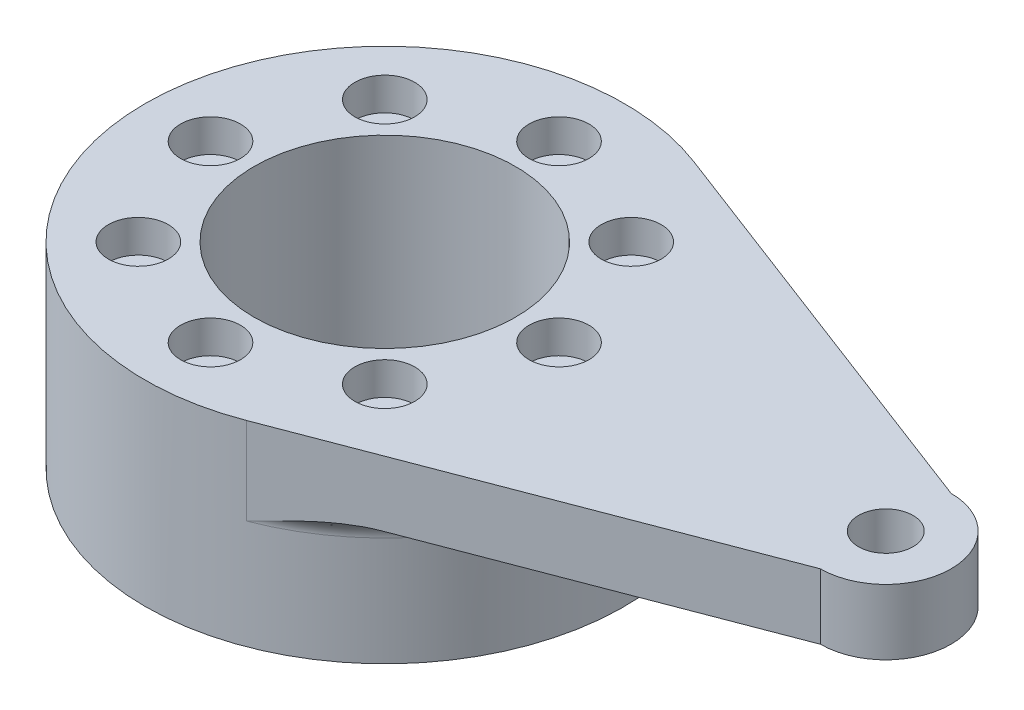
ISO-10303-21;
HEADER;
FILE_DESCRIPTION(('STEP AP214'),'2;1');
FILE_NAME('part.step','',(''),(''),'','','');
FILE_SCHEMA(('AUTOMOTIVE_DESIGN { 1 0 10303 214 1 1 1 1 }'));
ENDSEC;
DATA;
#1=APPLICATION_CONTEXT('core data for automotive mechanical design processes');
#2=APPLICATION_PROTOCOL_DEFINITION('international standard','automotive_design',2000,#1);
#3=PRODUCT_CONTEXT('',#1,'mechanical');
#4=PRODUCT('Part','Part','',(#3));
#5=PRODUCT_RELATED_PRODUCT_CATEGORY('part','',(#4));
#6=PRODUCT_DEFINITION_FORMATION('','',#4);
#7=PRODUCT_DEFINITION_CONTEXT('part definition',#1,'design');
#8=PRODUCT_DEFINITION('design','',#6,#7);
#9=PRODUCT_DEFINITION_SHAPE('','',#8);
#10=(LENGTH_UNIT() NAMED_UNIT(*) SI_UNIT(.MILLI.,.METRE.));
#11=(NAMED_UNIT(*) PLANE_ANGLE_UNIT() SI_UNIT($,.RADIAN.));
#12=(NAMED_UNIT(*) SI_UNIT($,.STERADIAN.) SOLID_ANGLE_UNIT());
#13=UNCERTAINTY_MEASURE_WITH_UNIT(LENGTH_MEASURE(1.E-05),#10,'distance_accuracy_value','');
#14=(GEOMETRIC_REPRESENTATION_CONTEXT(3) GLOBAL_UNCERTAINTY_ASSIGNED_CONTEXT((#13)) GLOBAL_UNIT_ASSIGNED_CONTEXT((#10,
#11,#12)) REPRESENTATION_CONTEXT('',''));
#15=CARTESIAN_POINT('',(0.,0.,0.));
#16=DIRECTION('',(0.,0.,1.));
#17=DIRECTION('',(1.,0.,0.));
#18=AXIS2_PLACEMENT_3D('',#15,#16,#17);
#19=CARTESIAN_POINT('',(-16.,12.,0.));
#20=DIRECTION('',(0.,-1.,0.));
#21=DIRECTION('',(0.,0.,-1.));
#22=AXIS2_PLACEMENT_3D('',#19,#20,#21);
#23=CYLINDRICAL_SURFACE('',#22,1.25);
#24=CARTESIAN_POINT('',(-16.,0.,0.));
#25=DIRECTION('',(0.,1.,0.));
#26=DIRECTION('',(0.,0.,1.));
#27=AXIS2_PLACEMENT_3D('',#24,#25,#26);
#28=CIRCLE('',#27,1.25);
#29=CARTESIAN_POINT('',(-16.,0.,1.25));
#30=VERTEX_POINT('',#29);
#31=EDGE_CURVE('E181',#30,#30,#28,.T.);
#32=ORIENTED_EDGE('',*,*,#31,.F.);
#33=EDGE_LOOP('',(#32));
#34=FACE_BOUND('',#33,.T.);
#35=CARTESIAN_POINT('',(-16.,15.,0.));
#36=DIRECTION('',(0.,1.,0.));
#37=DIRECTION('',(0.,0.,1.));
#38=AXIS2_PLACEMENT_3D('',#35,#36,#37);
#39=CIRCLE('',#38,1.25);
#40=CARTESIAN_POINT('',(-16.,15.,1.25));
#41=VERTEX_POINT('',#40);
#42=EDGE_CURVE('E331',#41,#41,#39,.F.);
#43=ORIENTED_EDGE('',*,*,#42,.F.);
#44=EDGE_LOOP('',(#43));
#45=FACE_BOUND('',#44,.T.);
#46=ADVANCED_FACE('F40',(#34,#45),#23,.F.);
#47=CARTESIAN_POINT('',(-11.3137084989847,12.,-11.3137084989848));
#48=DIRECTION('',(0.,-1.,0.));
#49=DIRECTION('',(0.,0.,-1.));
#50=AXIS2_PLACEMENT_3D('',#47,#48,#49);
#51=CYLINDRICAL_SURFACE('',#50,1.25);
#52=CARTESIAN_POINT('',(-11.3137084989847,0.,-11.3137084989848));
#53=DIRECTION('',(0.,1.,0.));
#54=DIRECTION('',(0.,0.,1.));
#55=AXIS2_PLACEMENT_3D('',#52,#53,#54);
#56=CIRCLE('',#55,1.25);
#57=CARTESIAN_POINT('',(-11.3137084989847,0.,-10.0637084989848));
#58=VERTEX_POINT('',#57);
#59=EDGE_CURVE('E177',#58,#58,#56,.T.);
#60=ORIENTED_EDGE('',*,*,#59,.F.);
#61=EDGE_LOOP('',(#60));
#62=FACE_BOUND('',#61,.T.);
#63=CARTESIAN_POINT('',(-11.3137084989847,15.,-11.3137084989848));
#64=DIRECTION('',(0.,1.,0.));
#65=DIRECTION('',(0.,0.,1.));
#66=AXIS2_PLACEMENT_3D('',#63,#64,#65);
#67=CIRCLE('',#66,1.25);
#68=CARTESIAN_POINT('',(-11.3137084989847,15.,-10.0637084989848));
#69=VERTEX_POINT('',#68);
#70=EDGE_CURVE('E295',#69,#69,#67,.F.);
#71=ORIENTED_EDGE('',*,*,#70,.F.);
#72=EDGE_LOOP('',(#71));
#73=FACE_BOUND('',#72,.T.);
#74=ADVANCED_FACE('F238',(#62,#73),#51,.F.);
#75=CARTESIAN_POINT('',(0.,12.,-16.));
#76=DIRECTION('',(0.,-1.,0.));
#77=DIRECTION('',(0.,0.,-1.));
#78=AXIS2_PLACEMENT_3D('',#75,#76,#77);
#79=CYLINDRICAL_SURFACE('',#78,1.25);
#80=CARTESIAN_POINT('',(0.,0.,-16.));
#81=DIRECTION('',(0.,1.,0.));
#82=DIRECTION('',(0.,0.,1.));
#83=AXIS2_PLACEMENT_3D('',#80,#81,#82);
#84=CIRCLE('',#83,1.25);
#85=CARTESIAN_POINT('',(0.,0.,-14.75));
#86=VERTEX_POINT('',#85);
#87=EDGE_CURVE('E173',#86,#86,#84,.T.);
#88=ORIENTED_EDGE('',*,*,#87,.F.);
#89=EDGE_LOOP('',(#88));
#90=FACE_BOUND('',#89,.T.);
#91=CARTESIAN_POINT('',(0.,15.,-16.));
#92=DIRECTION('',(0.,1.,0.));
#93=DIRECTION('',(0.,0.,1.));
#94=AXIS2_PLACEMENT_3D('',#91,#92,#93);
#95=CIRCLE('',#94,1.25);
#96=CARTESIAN_POINT('',(0.,15.,-14.75));
#97=VERTEX_POINT('',#96);
#98=EDGE_CURVE('E307',#97,#97,#95,.F.);
#99=ORIENTED_EDGE('',*,*,#98,.F.);
#100=EDGE_LOOP('',(#99));
#101=FACE_BOUND('',#100,.T.);
#102=ADVANCED_FACE('F234',(#90,#101),#79,.F.);
#103=CARTESIAN_POINT('',(11.3137084989848,12.,-11.3137084989847));
#104=DIRECTION('',(0.,-1.,0.));
#105=DIRECTION('',(0.,0.,-1.));
#106=AXIS2_PLACEMENT_3D('',#103,#104,#105);
#107=CYLINDRICAL_SURFACE('',#106,1.25);
#108=CARTESIAN_POINT('',(11.3137084989848,0.,-11.3137084989847));
#109=DIRECTION('',(0.,1.,0.));
#110=DIRECTION('',(0.,0.,1.));
#111=AXIS2_PLACEMENT_3D('',#108,#109,#110);
#112=CIRCLE('',#111,1.25);
#113=CARTESIAN_POINT('',(11.3137084989848,0.,-10.0637084989847));
#114=VERTEX_POINT('',#113);
#115=EDGE_CURVE('E169',#114,#114,#112,.T.);
#116=ORIENTED_EDGE('',*,*,#115,.F.);
#117=EDGE_LOOP('',(#116));
#118=FACE_BOUND('',#117,.T.);
#119=CARTESIAN_POINT('',(11.3137084989848,15.,-11.3137084989847));
#120=DIRECTION('',(0.,1.,0.));
#121=DIRECTION('',(0.,0.,1.));
#122=AXIS2_PLACEMENT_3D('',#119,#120,#121);
#123=CIRCLE('',#122,1.25);
#124=CARTESIAN_POINT('',(11.3137084989848,15.,-10.0637084989847));
#125=VERTEX_POINT('',#124);
#126=EDGE_CURVE('E319',#125,#125,#123,.F.);
#127=ORIENTED_EDGE('',*,*,#126,.F.);
#128=EDGE_LOOP('',(#127));
#129=FACE_BOUND('',#128,.T.);
#130=ADVANCED_FACE('F230',(#118,#129),#107,.F.);
#131=CARTESIAN_POINT('',(16.,12.,1.1172740284298E-13));
#132=DIRECTION('',(0.,-1.,0.));
#133=DIRECTION('',(0.,0.,-1.));
#134=AXIS2_PLACEMENT_3D('',#131,#132,#133);
#135=CYLINDRICAL_SURFACE('',#134,1.25);
#136=CARTESIAN_POINT('',(16.,0.,1.1172740284298E-13));
#137=DIRECTION('',(0.,1.,0.));
#138=DIRECTION('',(0.,0.,1.));
#139=AXIS2_PLACEMENT_3D('',#136,#137,#138);
#140=CIRCLE('',#139,1.25);
#141=CARTESIAN_POINT('',(16.,0.,1.25000000000011));
#142=VERTEX_POINT('',#141);
#143=EDGE_CURVE('E165',#142,#142,#140,.T.);
#144=ORIENTED_EDGE('',*,*,#143,.F.);
#145=EDGE_LOOP('',(#144));
#146=FACE_BOUND('',#145,.T.);
#147=CARTESIAN_POINT('',(16.,15.,1.1172740284298E-13));
#148=DIRECTION('',(0.,1.,0.));
#149=DIRECTION('',(0.,0.,1.));
#150=AXIS2_PLACEMENT_3D('',#147,#148,#149);
#151=CIRCLE('',#150,1.25);
#152=CARTESIAN_POINT('',(16.,15.,1.25000000000011));
#153=VERTEX_POINT('',#152);
#154=EDGE_CURVE('E496',#153,#153,#151,.F.);
#155=ORIENTED_EDGE('',*,*,#154,.F.);
#156=EDGE_LOOP('',(#155));
#157=FACE_BOUND('',#156,.T.);
#158=ADVANCED_FACE('F226',(#146,#157),#135,.F.);
#159=CARTESIAN_POINT('',(11.3137084989847,12.,11.3137084989849));
#160=DIRECTION('',(0.,-1.,0.));
#161=DIRECTION('',(0.,0.,-1.));
#162=AXIS2_PLACEMENT_3D('',#159,#160,#161);
#163=CYLINDRICAL_SURFACE('',#162,1.25);
#164=CARTESIAN_POINT('',(11.3137084989847,0.,11.3137084989849));
#165=DIRECTION('',(0.,1.,0.));
#166=DIRECTION('',(0.,0.,1.));
#167=AXIS2_PLACEMENT_3D('',#164,#165,#166);
#168=CIRCLE('',#167,1.25);
#169=CARTESIAN_POINT('',(11.3137084989847,0.,12.5637084989849));
#170=VERTEX_POINT('',#169);
#171=EDGE_CURVE('E161',#170,#170,#168,.T.);
#172=ORIENTED_EDGE('',*,*,#171,.F.);
#173=EDGE_LOOP('',(#172));
#174=FACE_BOUND('',#173,.T.);
#175=CARTESIAN_POINT('',(11.3137084989847,15.,11.3137084989849));
#176=DIRECTION('',(0.,1.,0.));
#177=DIRECTION('',(0.,0.,1.));
#178=AXIS2_PLACEMENT_3D('',#175,#176,#177);
#179=CIRCLE('',#178,1.25);
#180=CARTESIAN_POINT('',(11.3137084989847,15.,12.5637084989849));
#181=VERTEX_POINT('',#180);
#182=EDGE_CURVE('E508',#181,#181,#179,.F.);
#183=ORIENTED_EDGE('',*,*,#182,.F.);
#184=EDGE_LOOP('',(#183));
#185=FACE_BOUND('',#184,.T.);
#186=ADVANCED_FACE('F222',(#174,#185),#163,.F.);
#187=CARTESIAN_POINT('',(-1.6759110426447E-13,12.,16.));
#188=DIRECTION('',(0.,-1.,0.));
#189=DIRECTION('',(0.,0.,-1.));
#190=AXIS2_PLACEMENT_3D('',#187,#188,#189);
#191=CYLINDRICAL_SURFACE('',#190,1.25);
#192=CARTESIAN_POINT('',(-1.6759110426447E-13,0.,16.));
#193=DIRECTION('',(0.,1.,0.));
#194=DIRECTION('',(0.,0.,1.));
#195=AXIS2_PLACEMENT_3D('',#192,#193,#194);
#196=CIRCLE('',#195,1.25);
#197=CARTESIAN_POINT('',(-1.6759110426447E-13,0.,17.25));
#198=VERTEX_POINT('',#197);
#199=EDGE_CURVE('E157',#198,#198,#196,.T.);
#200=ORIENTED_EDGE('',*,*,#199,.F.);
#201=EDGE_LOOP('',(#200));
#202=FACE_BOUND('',#201,.T.);
#203=CARTESIAN_POINT('',(-1.6759110426447E-13,15.,16.));
#204=DIRECTION('',(0.,1.,0.));
#205=DIRECTION('',(0.,0.,1.));
#206=AXIS2_PLACEMENT_3D('',#203,#204,#205);
#207=CIRCLE('',#206,1.25);
#208=CARTESIAN_POINT('',(-1.6759110426447E-13,15.,17.25));
#209=VERTEX_POINT('',#208);
#210=EDGE_CURVE('E520',#209,#209,#207,.F.);
#211=ORIENTED_EDGE('',*,*,#210,.F.);
#212=EDGE_LOOP('',(#211));
#213=FACE_BOUND('',#212,.T.);
#214=ADVANCED_FACE('F218',(#202,#213),#191,.F.);
#215=CARTESIAN_POINT('',(-11.3137084989849,12.,11.3137084989846));
#216=DIRECTION('',(0.,-1.,0.));
#217=DIRECTION('',(0.,0.,-1.));
#218=AXIS2_PLACEMENT_3D('',#215,#216,#217);
#219=CYLINDRICAL_SURFACE('',#218,1.25);
#220=CARTESIAN_POINT('',(-11.3137084989849,0.,11.3137084989846));
#221=DIRECTION('',(0.,1.,0.));
#222=DIRECTION('',(0.,0.,1.));
#223=AXIS2_PLACEMENT_3D('',#220,#221,#222);
#224=CIRCLE('',#223,1.25);
#225=CARTESIAN_POINT('',(-11.3137084989849,0.,12.5637084989846));
#226=VERTEX_POINT('',#225);
#227=EDGE_CURVE('E103',#226,#226,#224,.T.);
#228=ORIENTED_EDGE('',*,*,#227,.F.);
#229=EDGE_LOOP('',(#228));
#230=FACE_BOUND('',#229,.T.);
#231=CARTESIAN_POINT('',(-11.3137084989849,15.,11.3137084989846));
#232=DIRECTION('',(0.,1.,0.));
#233=DIRECTION('',(0.,0.,1.));
#234=AXIS2_PLACEMENT_3D('',#231,#232,#233);
#235=CIRCLE('',#234,1.25);
#236=CARTESIAN_POINT('',(-11.3137084989849,15.,12.5637084989846));
#237=VERTEX_POINT('',#236);
#238=EDGE_CURVE('E276',#237,#237,#235,.F.);
#239=ORIENTED_EDGE('',*,*,#238,.F.);
#240=EDGE_LOOP('',(#239));
#241=FACE_BOUND('',#240,.T.);
#242=ADVANCED_FACE('F214',(#230,#241),#219,.F.);
#243=CARTESIAN_POINT('',(0.,0.,0.));
#244=DIRECTION('',(0.,1.,0.));
#245=DIRECTION('',(0.,0.,1.));
#246=AXIS2_PLACEMENT_3D('',#243,#244,#245);
#247=PLANE('',#246);
#248=CARTESIAN_POINT('',(0.,0.,0.));
#249=DIRECTION('',(0.,1.,0.));
#250=DIRECTION('',(0.,0.,1.));
#251=AXIS2_PLACEMENT_3D('',#248,#249,#250);
#252=CIRCLE('',#251,12.);
#253=CARTESIAN_POINT('',(0.,0.,12.));
#254=VERTEX_POINT('',#253);
#255=EDGE_CURVE('E486',#254,#254,#252,.T.);
#256=ORIENTED_EDGE('',*,*,#255,.T.);
#257=EDGE_LOOP('',(#256));
#258=FACE_BOUND('',#257,.T.);
#259=CARTESIAN_POINT('',(-6.1229349178416,0.,-14.7820725201805));
#260=DIRECTION('',(0.,-1.,0.));
#261=DIRECTION('',(0.,0.,-1.));
#262=AXIS2_PLACEMENT_3D('',#259,#260,#261);
#263=CIRCLE('',#262,2.05);
#264=CARTESIAN_POINT('',(-6.1229349178416,0.,-16.8320725201805));
#265=VERTEX_POINT('',#264);
#266=EDGE_CURVE('E345',#265,#265,#263,.T.);
#267=ORIENTED_EDGE('',*,*,#266,.F.);
#268=EDGE_LOOP('',(#267));
#269=FACE_BOUND('',#268,.T.);
#270=CARTESIAN_POINT('',(-14.7820725201806,0.,6.12293491784145));
#271=DIRECTION('',(0.,-1.,0.));
#272=DIRECTION('',(0.,0.,-1.));
#273=AXIS2_PLACEMENT_3D('',#270,#271,#272);
#274=CIRCLE('',#273,2.05);
#275=CARTESIAN_POINT('',(-14.7820725201806,0.,4.07293491784145));
#276=VERTEX_POINT('',#275);
#277=EDGE_CURVE('E353',#276,#276,#274,.T.);
#278=ORIENTED_EDGE('',*,*,#277,.F.);
#279=EDGE_LOOP('',(#278));
#280=FACE_BOUND('',#279,.T.);
#281=CARTESIAN_POINT('',(14.7820725201805,0.,-6.12293491784155));
#282=DIRECTION('',(0.,-1.,0.));
#283=DIRECTION('',(0.,0.,-1.));
#284=AXIS2_PLACEMENT_3D('',#281,#282,#283);
#285=CIRCLE('',#284,2.05);
#286=CARTESIAN_POINT('',(14.7820725201805,0.,-8.17293491784155));
#287=VERTEX_POINT('',#286);
#288=EDGE_CURVE('E361',#287,#287,#285,.T.);
#289=ORIENTED_EDGE('',*,*,#288,.F.);
#290=EDGE_LOOP('',(#289));
#291=FACE_BOUND('',#290,.T.);
#292=CARTESIAN_POINT('',(6.1229349178415,0.,14.7820725201806));
#293=DIRECTION('',(0.,-1.,0.));
#294=DIRECTION('',(0.,0.,-1.));
#295=AXIS2_PLACEMENT_3D('',#292,#293,#294);
#296=CIRCLE('',#295,2.05);
#297=CARTESIAN_POINT('',(6.1229349178415,0.,12.7320725201806));
#298=VERTEX_POINT('',#297);
#299=EDGE_CURVE('E128',#298,#298,#296,.T.);
#300=ORIENTED_EDGE('',*,*,#299,.F.);
#301=EDGE_LOOP('',(#300));
#302=FACE_BOUND('',#301,.T.);
#303=CARTESIAN_POINT('',(0.,0.,0.));
#304=DIRECTION('',(0.,1.,0.));
#305=DIRECTION('',(0.,0.,1.));
#306=AXIS2_PLACEMENT_3D('',#303,#304,#305);
#307=CIRCLE('',#306,22.);
#308=CARTESIAN_POINT('',(0.,0.,22.));
#309=VERTEX_POINT('',#308);
#310=EDGE_CURVE('E185',#309,#309,#307,.T.);
#311=ORIENTED_EDGE('',*,*,#310,.F.);
#312=EDGE_LOOP('',(#311));
#313=FACE_BOUND('',#312,.T.);
#314=ORIENTED_EDGE('',*,*,#31,.T.);
#315=EDGE_LOOP('',(#314));
#316=FACE_BOUND('',#315,.T.);
#317=ORIENTED_EDGE('',*,*,#59,.T.);
#318=EDGE_LOOP('',(#317));
#319=FACE_BOUND('',#318,.T.);
#320=ORIENTED_EDGE('',*,*,#87,.T.);
#321=EDGE_LOOP('',(#320));
#322=FACE_BOUND('',#321,.T.);
#323=ORIENTED_EDGE('',*,*,#115,.T.);
#324=EDGE_LOOP('',(#323));
#325=FACE_BOUND('',#324,.T.);
#326=ORIENTED_EDGE('',*,*,#143,.T.);
#327=EDGE_LOOP('',(#326));
#328=FACE_BOUND('',#327,.T.);
#329=ORIENTED_EDGE('',*,*,#171,.T.);
#330=EDGE_LOOP('',(#329));
#331=FACE_BOUND('',#330,.T.);
#332=ORIENTED_EDGE('',*,*,#199,.T.);
#333=EDGE_LOOP('',(#332));
#334=FACE_BOUND('',#333,.T.);
#335=ORIENTED_EDGE('',*,*,#227,.T.);
#336=EDGE_LOOP('',(#335));
#337=FACE_BOUND('',#336,.T.);
#338=ADVANCED_FACE('F217',(#258,#269,#280,#291,#302,#313,#316,#319,#322,#325,#328,#331,#334,
#337),#247,.F.);
#339=CARTESIAN_POINT('',(0.,12.,0.));
#340=DIRECTION('',(0.,-1.,0.));
#341=DIRECTION('',(0.,0.,-1.));
#342=AXIS2_PLACEMENT_3D('',#339,#340,#341);
#343=CYLINDRICAL_SURFACE('',#342,22.);
#344=DIRECTION('',(0.,-1.,0.));
#345=VECTOR('',#344,1.);
#346=CARTESIAN_POINT('',(7.84059825550241,18.,-20.5554133744815));
#347=LINE('',#346,#345);
#348=CARTESIAN_POINT('',(7.84059825550241,18.,-20.5554133744815));
#349=VERTEX_POINT('',#348);
#350=CARTESIAN_POINT('',(7.84059825550241,10.,-20.5554133744815));
#351=VERTEX_POINT('',#350);
#352=EDGE_CURVE('E62',#349,#351,#347,.T.);
#353=ORIENTED_EDGE('',*,*,#352,.T.);
#354=CARTESIAN_POINT('',(0.,10.,0.));
#355=DIRECTION('',(0.,1.,0.));
#356=DIRECTION('',(0.,0.,1.));
#357=AXIS2_PLACEMENT_3D('',#354,#355,#356);
#358=CIRCLE('',#357,22.);
#359=CARTESIAN_POINT('',(7.84059825550241,10.,20.5554133744815));
#360=VERTEX_POINT('',#359);
#361=EDGE_CURVE('E193',#351,#360,#358,.F.);
#362=ORIENTED_EDGE('',*,*,#361,.T.);
#363=DIRECTION('',(0.,-1.,0.));
#364=VECTOR('',#363,1.);
#365=CARTESIAN_POINT('',(7.84059825550241,18.,20.5554133744815));
#366=LINE('',#365,#364);
#367=CARTESIAN_POINT('',(7.84059825550241,18.,20.5554133744815));
#368=VERTEX_POINT('',#367);
#369=EDGE_CURVE('E69',#368,#360,#366,.T.);
#370=ORIENTED_EDGE('',*,*,#369,.F.);
#371=CARTESIAN_POINT('',(0.,18.,0.));
#372=DIRECTION('',(0.,1.,0.));
#373=DIRECTION('',(0.,0.,1.));
#374=AXIS2_PLACEMENT_3D('',#371,#372,#373);
#375=CIRCLE('',#374,22.);
#376=EDGE_CURVE('E118',#349,#368,#375,.T.);
#377=ORIENTED_EDGE('',*,*,#376,.F.);
#378=EDGE_LOOP('',(#353,#362,#370,#377));
#379=FACE_BOUND('',#378,.T.);
#380=ORIENTED_EDGE('',*,*,#310,.T.);
#381=EDGE_LOOP('',(#380));
#382=FACE_BOUND('',#381,.T.);
#383=ADVANCED_FACE('F247',(#379,#382),#343,.T.);
#384=CARTESIAN_POINT('',(0.,12.,0.));
#385=DIRECTION('',(0.,1.,0.));
#386=DIRECTION('',(0.,0.,1.));
#387=AXIS2_PLACEMENT_3D('',#384,#385,#386);
#388=PLANE('',#387);
#389=CARTESIAN_POINT('',(46.,12.,0.));
#390=DIRECTION('',(0.,1.,0.));
#391=DIRECTION('',(0.,0.,1.));
#392=AXIS2_PLACEMENT_3D('',#389,#390,#391);
#393=CIRCLE('',#392,2.5);
#394=CARTESIAN_POINT('',(46.,12.,2.5));
#395=VERTEX_POINT('',#394);
#396=EDGE_CURVE('E120',#395,#395,#393,.T.);
#397=ORIENTED_EDGE('',*,*,#396,.T.);
#398=EDGE_LOOP('',(#397));
#399=FACE_BOUND('',#398,.T.);
#400=DIRECTION('',(-0.93433697156734,0.,0.356390829795564));
#401=VECTOR('',#400,1.);
#402=CARTESIAN_POINT('',(7.84059825550241,12.,20.5554133744815));
#403=LINE('',#402,#401);
#404=CARTESIAN_POINT('',(46.,12.,6.));
#405=VERTEX_POINT('',#404);
#406=CARTESIAN_POINT('',(16.8024436587808,12.,17.1370326221752));
#407=VERTEX_POINT('',#406);
#408=EDGE_CURVE('E98',#405,#407,#403,.T.);
#409=ORIENTED_EDGE('',*,*,#408,.T.);
#410=CARTESIAN_POINT('',(0.,12.,0.));
#411=DIRECTION('',(0.,1.,0.));
#412=DIRECTION('',(0.,0.,1.));
#413=AXIS2_PLACEMENT_3D('',#410,#411,#412);
#414=CIRCLE('',#413,24.);
#415=CARTESIAN_POINT('',(16.8024436587808,12.,-17.1370326221752));
#416=VERTEX_POINT('',#415);
#417=EDGE_CURVE('E189',#407,#416,#414,.T.);
#418=ORIENTED_EDGE('',*,*,#417,.T.);
#419=DIRECTION('',(-0.93433697156734,0.,-0.356390829795564));
#420=VECTOR('',#419,1.);
#421=CARTESIAN_POINT('',(7.84059825550241,12.,-20.5554133744815));
#422=LINE('',#421,#420);
#423=CARTESIAN_POINT('',(46.,12.,-6.));
#424=VERTEX_POINT('',#423);
#425=EDGE_CURVE('E125',#424,#416,#422,.T.);
#426=ORIENTED_EDGE('',*,*,#425,.F.);
#427=CARTESIAN_POINT('',(46.,12.,0.));
#428=DIRECTION('',(0.,1.,0.));
#429=DIRECTION('',(0.,0.,1.));
#430=AXIS2_PLACEMENT_3D('',#427,#428,#429);
#431=CIRCLE('',#430,6.);
#432=EDGE_CURVE('E141',#405,#424,#431,.T.);
#433=ORIENTED_EDGE('',*,*,#432,.F.);
#434=EDGE_LOOP('',(#409,#418,#426,#433));
#435=FACE_BOUND('',#434,.T.);
#436=ADVANCED_FACE('F213',(#399,#435),#388,.F.);
#437=CARTESIAN_POINT('',(7.84059825550241,18.,20.5554133744815));
#438=DIRECTION('',(0.356390829795564,0.,0.93433697156734));
#439=DIRECTION('',(0.934336971567341,0.,-0.356390829795564));
#440=AXIS2_PLACEMENT_3D('',#437,#438,#439);
#441=PLANE('',#440);
#442=ORIENTED_EDGE('',*,*,#408,.F.);
#443=DIRECTION('',(0.,-1.,0.));
#444=VECTOR('',#443,1.);
#445=CARTESIAN_POINT('',(46.,18.,6.));
#446=LINE('',#445,#444);
#447=CARTESIAN_POINT('',(46.,18.,6.));
#448=VERTEX_POINT('',#447);
#449=EDGE_CURVE('E92',#448,#405,#446,.T.);
#450=ORIENTED_EDGE('',*,*,#449,.F.);
#451=DIRECTION('',(-0.93433697156734,0.,0.356390829795564));
#452=VECTOR('',#451,1.);
#453=CARTESIAN_POINT('',(7.84059825550241,18.,20.5554133744815));
#454=LINE('',#453,#452);
#455=EDGE_CURVE('E96',#448,#368,#454,.T.);
#456=ORIENTED_EDGE('',*,*,#455,.T.);
#457=ORIENTED_EDGE('',*,*,#369,.T.);
#458=CARTESIAN_POINT('',(16.8024436587808,12.,17.1370326221752));
#459=CARTESIAN_POINT('',(16.6447027714641,11.9999762948153,17.1972008563715));
#460=CARTESIAN_POINT('',(16.486989567504,11.9965866675517,17.2573585311071));
#461=CARTESIAN_POINT('',(16.1718203242431,11.9838003751437,17.3775757884242));
#462=CARTESIAN_POINT('',(16.0143642209264,11.9744055518785,17.4376353954237));
#463=CARTESIAN_POINT('',(15.7000352549024,11.9503496997234,17.557532139788));
#464=CARTESIAN_POINT('',(15.5431618833756,11.9356960954993,17.6173694712354));
#465=CARTESIAN_POINT('',(15.2298514174152,11.9017004091527,17.73687772184));
#466=CARTESIAN_POINT('',(15.0734143619755,11.8823579207548,17.7965486261235));
#467=CARTESIAN_POINT('',(14.6065213430878,11.8183145852962,17.9746389677141));
#468=CARTESIAN_POINT('',(14.2967966939894,11.7674570730959,18.0927794545613));
#469=CARTESIAN_POINT('',(13.679402370757,11.6526128471442,18.3282765844659));
#470=CARTESIAN_POINT('',(13.3717336256647,11.5886205641736,18.4456328731523));
#471=CARTESIAN_POINT('',(12.6260706411212,11.4203652927699,18.7300564354175));
#472=CARTESIAN_POINT('',(12.1891587086289,11.3106439280728,18.8967108769167));
#473=CARTESIAN_POINT('',(11.3189029453068,11.0763949836736,19.2286587533926));
#474=CARTESIAN_POINT('',(10.8855590284351,10.9518677621369,19.393952221189));
#475=CARTESIAN_POINT('',(9.58798236063764,10.5638342234291,19.8888961647899));
#476=CARTESIAN_POINT('',(8.72749804892183,10.2862028437589,20.2171168466324));
#477=CARTESIAN_POINT('',(7.85828953115385,10.0057089732058,20.5486652647508));
#478=CARTESIAN_POINT('',(7.84944388955644,10.0028544768059,20.5520393210548));
#479=CARTESIAN_POINT('',(7.84059825550242,10.,20.5554133744815));
#480=B_SPLINE_CURVE_WITH_KNOTS('',3,(#458,#459,#460,#461,#462,#463,#464,#465,#466,#467,#468,
#469,#470,#471,#472,#473,#474,#475,#476,#477,#478,#479),.UNSPECIFIED.,.F.,.F.,(4,2,2,2,2,2,2,2,
2,2,4),(0.,0.506403608546306,1.01265197037599,1.51818837400446,2.02376859625181,
3.02950309914149,4.03566492350481,5.47622525419607,6.91675074369697,9.80206434583899,
9.83172913978732),.UNSPECIFIED.);
#481=EDGE_CURVE('E11',#360,#407,#480,.F.);
#482=ORIENTED_EDGE('',*,*,#481,.T.);
#483=EDGE_LOOP('',(#442,#450,#456,#457,#482));
#484=FACE_BOUND('',#483,.T.);
#485=ADVANCED_FACE('F94',(#484),#441,.T.);
#486=CARTESIAN_POINT('',(46.,18.,0.));
#487=DIRECTION('',(0.,-1.,0.));
#488=DIRECTION('',(0.,0.,-1.));
#489=AXIS2_PLACEMENT_3D('',#486,#487,#488);
#490=CYLINDRICAL_SURFACE('',#489,6.);
#491=ORIENTED_EDGE('',*,*,#432,.T.);
#492=DIRECTION('',(0.,-1.,0.));
#493=VECTOR('',#492,1.);
#494=CARTESIAN_POINT('',(46.,18.,-6.));
#495=LINE('',#494,#493);
#496=CARTESIAN_POINT('',(46.,18.,-6.));
#497=VERTEX_POINT('',#496);
#498=EDGE_CURVE('E104',#497,#424,#495,.T.);
#499=ORIENTED_EDGE('',*,*,#498,.F.);
#500=CARTESIAN_POINT('',(46.,18.,0.));
#501=DIRECTION('',(0.,1.,0.));
#502=DIRECTION('',(0.,0.,1.));
#503=AXIS2_PLACEMENT_3D('',#500,#501,#502);
#504=CIRCLE('',#503,6.);
#505=EDGE_CURVE('E108',#448,#497,#504,.T.);
#506=ORIENTED_EDGE('',*,*,#505,.F.);
#507=ORIENTED_EDGE('',*,*,#449,.T.);
#508=EDGE_LOOP('',(#491,#499,#506,#507));
#509=FACE_BOUND('',#508,.T.);
#510=ADVANCED_FACE('F109',(#509),#490,.T.);
#511=CARTESIAN_POINT('',(7.84059825550241,18.,-20.5554133744815));
#512=DIRECTION('',(-0.356390829795564,0.,0.93433697156734));
#513=DIRECTION('',(0.934336971567341,0.,0.356390829795564));
#514=AXIS2_PLACEMENT_3D('',#511,#512,#513);
#515=PLANE('',#514);
#516=ORIENTED_EDGE('',*,*,#425,.T.);
#517=CARTESIAN_POINT('',(16.8024436587808,12.,-17.1370326221752));
#518=CARTESIAN_POINT('',(16.6447027714641,11.9999762948153,-17.1972008563715));
#519=CARTESIAN_POINT('',(16.486989567504,11.9965866675517,-17.2573585311071));
#520=CARTESIAN_POINT('',(16.1718203242431,11.9838003751437,-17.3775757884242));
#521=CARTESIAN_POINT('',(16.0143642209264,11.9744055518785,-17.4376353954237));
#522=CARTESIAN_POINT('',(15.7000352549024,11.9503496997234,-17.557532139788));
#523=CARTESIAN_POINT('',(15.5431618833756,11.9356960954993,-17.6173694712354));
#524=CARTESIAN_POINT('',(15.2298514174152,11.9017004091527,-17.73687772184));
#525=CARTESIAN_POINT('',(15.0734143619755,11.8823579207548,-17.7965486261235));
#526=CARTESIAN_POINT('',(14.6065213430878,11.8183145852962,-17.9746389677141));
#527=CARTESIAN_POINT('',(14.2967966939894,11.7674570730959,-18.0927794545613));
#528=CARTESIAN_POINT('',(13.679402370757,11.6526128471442,-18.3282765844659));
#529=CARTESIAN_POINT('',(13.3717336256647,11.5886205641736,-18.4456328731523));
#530=CARTESIAN_POINT('',(12.6260706411212,11.4203652927699,-18.7300564354175));
#531=CARTESIAN_POINT('',(12.1891587086289,11.3106439280728,-18.8967108769167));
#532=CARTESIAN_POINT('',(11.3189029453068,11.0763949836736,-19.2286587533926));
#533=CARTESIAN_POINT('',(10.8855590284351,10.9518677621369,-19.393952221189));
#534=CARTESIAN_POINT('',(9.58798236063764,10.5638342234291,-19.8888961647899));
#535=CARTESIAN_POINT('',(8.72749804892183,10.2862028437589,-20.2171168466324));
#536=CARTESIAN_POINT('',(7.85828953115385,10.0057089732058,-20.5486652647508));
#537=CARTESIAN_POINT('',(7.84944388955644,10.0028544768059,-20.5520393210548));
#538=CARTESIAN_POINT('',(7.84059825550242,10.,-20.5554133744815));
#539=B_SPLINE_CURVE_WITH_KNOTS('',3,(#517,#518,#519,#520,#521,#522,#523,#524,#525,#526,#527,
#528,#529,#530,#531,#532,#533,#534,#535,#536,#537,#538),.UNSPECIFIED.,.F.,.F.,(4,2,2,2,2,2,2,2,
2,2,4),(0.,0.506403608546306,1.01265197037599,1.51818837400446,2.02376859625181,
3.02950309914149,4.03566492350481,5.47622525419607,6.91675074369697,9.80206434583899,
9.83172913978732),.UNSPECIFIED.);
#540=EDGE_CURVE('E55',#416,#351,#539,.T.);
#541=ORIENTED_EDGE('',*,*,#540,.T.);
#542=ORIENTED_EDGE('',*,*,#352,.F.);
#543=DIRECTION('',(-0.93433697156734,0.,-0.356390829795564));
#544=VECTOR('',#543,1.);
#545=CARTESIAN_POINT('',(7.84059825550241,18.,-20.5554133744815));
#546=LINE('',#545,#544);
#547=EDGE_CURVE('E114',#497,#349,#546,.T.);
#548=ORIENTED_EDGE('',*,*,#547,.F.);
#549=ORIENTED_EDGE('',*,*,#498,.T.);
#550=EDGE_LOOP('',(#516,#541,#542,#548,#549));
#551=FACE_BOUND('',#550,.T.);
#552=ADVANCED_FACE('F201',(#551),#515,.F.);
#553=CARTESIAN_POINT('',(46.,18.,0.));
#554=DIRECTION('',(0.,-1.,0.));
#555=DIRECTION('',(0.,0.,-1.));
#556=AXIS2_PLACEMENT_3D('',#553,#554,#555);
#557=CYLINDRICAL_SURFACE('',#556,2.5);
#558=CARTESIAN_POINT('',(46.,18.,0.));
#559=DIRECTION('',(0.,1.,0.));
#560=DIRECTION('',(0.,0.,1.));
#561=AXIS2_PLACEMENT_3D('',#558,#559,#560);
#562=CIRCLE('',#561,2.5);
#563=CARTESIAN_POINT('',(46.,18.,2.5));
#564=VERTEX_POINT('',#563);
#565=EDGE_CURVE('E135',#564,#564,#562,.T.);
#566=ORIENTED_EDGE('',*,*,#565,.T.);
#567=EDGE_LOOP('',(#566));
#568=FACE_BOUND('',#567,.T.);
#569=ORIENTED_EDGE('',*,*,#396,.F.);
#570=EDGE_LOOP('',(#569));
#571=FACE_BOUND('',#570,.T.);
#572=ADVANCED_FACE('F206',(#568,#571),#557,.F.);
#573=CARTESIAN_POINT('',(0.,18.,0.));
#574=DIRECTION('',(0.,1.,0.));
#575=DIRECTION('',(0.,0.,1.));
#576=AXIS2_PLACEMENT_3D('',#573,#574,#575);
#577=PLANE('',#576);
#578=CARTESIAN_POINT('',(0.,18.,0.));
#579=DIRECTION('',(0.,1.,0.));
#580=DIRECTION('',(0.,0.,1.));
#581=AXIS2_PLACEMENT_3D('',#578,#579,#580);
#582=CIRCLE('',#581,12.);
#583=CARTESIAN_POINT('',(0.,18.,12.));
#584=VERTEX_POINT('',#583);
#585=EDGE_CURVE('E489',#584,#584,#582,.T.);
#586=ORIENTED_EDGE('',*,*,#585,.F.);
#587=EDGE_LOOP('',(#586));
#588=FACE_BOUND('',#587,.T.);
#589=CARTESIAN_POINT('',(-11.3137084989849,18.,11.3137084989846));
#590=DIRECTION('',(0.,1.,0.));
#591=DIRECTION('',(0.,0.,1.));
#592=AXIS2_PLACEMENT_3D('',#589,#590,#591);
#593=CIRCLE('',#592,2.75);
#594=CARTESIAN_POINT('',(-11.3137084989849,18.,14.0637084989846));
#595=VERTEX_POINT('',#594);
#596=EDGE_CURVE('E280',#595,#595,#593,.T.);
#597=ORIENTED_EDGE('',*,*,#596,.F.);
#598=EDGE_LOOP('',(#597));
#599=FACE_BOUND('',#598,.T.);
#600=CARTESIAN_POINT('',(-11.3137084989847,18.,-11.3137084989848));
#601=DIRECTION('',(0.,1.,0.));
#602=DIRECTION('',(0.,0.,1.));
#603=AXIS2_PLACEMENT_3D('',#600,#601,#602);
#604=CIRCLE('',#603,2.75);
#605=CARTESIAN_POINT('',(-11.3137084989847,18.,-8.56370849898479));
#606=VERTEX_POINT('',#605);
#607=EDGE_CURVE('E299',#606,#606,#604,.T.);
#608=ORIENTED_EDGE('',*,*,#607,.F.);
#609=EDGE_LOOP('',(#608));
#610=FACE_BOUND('',#609,.T.);
#611=CARTESIAN_POINT('',(0.,18.,-16.));
#612=DIRECTION('',(0.,1.,0.));
#613=DIRECTION('',(0.,0.,1.));
#614=AXIS2_PLACEMENT_3D('',#611,#612,#613);
#615=CIRCLE('',#614,2.75);
#616=CARTESIAN_POINT('',(0.,18.,-13.25));
#617=VERTEX_POINT('',#616);
#618=EDGE_CURVE('E311',#617,#617,#615,.T.);
#619=ORIENTED_EDGE('',*,*,#618,.F.);
#620=EDGE_LOOP('',(#619));
#621=FACE_BOUND('',#620,.T.);
#622=CARTESIAN_POINT('',(11.3137084989848,18.,-11.3137084989847));
#623=DIRECTION('',(0.,1.,0.));
#624=DIRECTION('',(0.,0.,1.));
#625=AXIS2_PLACEMENT_3D('',#622,#623,#624);
#626=CIRCLE('',#625,2.75);
#627=CARTESIAN_POINT('',(11.3137084989848,18.,-8.5637084989847));
#628=VERTEX_POINT('',#627);
#629=EDGE_CURVE('E323',#628,#628,#626,.T.);
#630=ORIENTED_EDGE('',*,*,#629,.F.);
#631=EDGE_LOOP('',(#630));
#632=FACE_BOUND('',#631,.T.);
#633=CARTESIAN_POINT('',(16.,18.,1.1172740284298E-13));
#634=DIRECTION('',(0.,1.,0.));
#635=DIRECTION('',(0.,0.,1.));
#636=AXIS2_PLACEMENT_3D('',#633,#634,#635);
#637=CIRCLE('',#636,2.75);
#638=CARTESIAN_POINT('',(16.,18.,2.75000000000011));
#639=VERTEX_POINT('',#638);
#640=EDGE_CURVE('E500',#639,#639,#637,.T.);
#641=ORIENTED_EDGE('',*,*,#640,.F.);
#642=EDGE_LOOP('',(#641));
#643=FACE_BOUND('',#642,.T.);
#644=CARTESIAN_POINT('',(11.3137084989847,18.,11.3137084989849));
#645=DIRECTION('',(0.,1.,0.));
#646=DIRECTION('',(0.,0.,1.));
#647=AXIS2_PLACEMENT_3D('',#644,#645,#646);
#648=CIRCLE('',#647,2.75);
#649=CARTESIAN_POINT('',(11.3137084989847,18.,14.0637084989849));
#650=VERTEX_POINT('',#649);
#651=EDGE_CURVE('E512',#650,#650,#648,.T.);
#652=ORIENTED_EDGE('',*,*,#651,.F.);
#653=EDGE_LOOP('',(#652));
#654=FACE_BOUND('',#653,.T.);
#655=CARTESIAN_POINT('',(-1.6759110426447E-13,18.,16.));
#656=DIRECTION('',(0.,1.,0.));
#657=DIRECTION('',(0.,0.,1.));
#658=AXIS2_PLACEMENT_3D('',#655,#656,#657);
#659=CIRCLE('',#658,2.75);
#660=CARTESIAN_POINT('',(-1.6759110426447E-13,18.,18.75));
#661=VERTEX_POINT('',#660);
#662=EDGE_CURVE('E292',#661,#661,#659,.T.);
#663=ORIENTED_EDGE('',*,*,#662,.F.);
#664=EDGE_LOOP('',(#663));
#665=FACE_BOUND('',#664,.T.);
#666=CARTESIAN_POINT('',(-16.,18.,0.));
#667=DIRECTION('',(0.,1.,0.));
#668=DIRECTION('',(0.,0.,1.));
#669=AXIS2_PLACEMENT_3D('',#666,#667,#668);
#670=CIRCLE('',#669,2.75);
#671=CARTESIAN_POINT('',(-16.,18.,2.75));
#672=VERTEX_POINT('',#671);
#673=EDGE_CURVE('E286',#672,#672,#670,.T.);
#674=ORIENTED_EDGE('',*,*,#673,.F.);
#675=EDGE_LOOP('',(#674));
#676=FACE_BOUND('',#675,.T.);
#677=ORIENTED_EDGE('',*,*,#455,.F.);
#678=ORIENTED_EDGE('',*,*,#505,.T.);
#679=ORIENTED_EDGE('',*,*,#547,.T.);
#680=ORIENTED_EDGE('',*,*,#376,.T.);
#681=EDGE_LOOP('',(#677,#678,#679,#680));
#682=FACE_BOUND('',#681,.T.);
#683=ORIENTED_EDGE('',*,*,#565,.F.);
#684=EDGE_LOOP('',(#683));
#685=FACE_BOUND('',#684,.T.);
#686=ADVANCED_FACE('F116',(#588,#599,#610,#621,#632,#643,#654,#665,#676,#682,#685),#577,.T.);
#687=CARTESIAN_POINT('',(6.1229349178415,3.5,14.7820725201806));
#688=DIRECTION('',(0.,-1.,0.));
#689=DIRECTION('',(0.,0.,-1.));
#690=AXIS2_PLACEMENT_3D('',#687,#688,#689);
#691=CYLINDRICAL_SURFACE('',#690,2.05);
#692=CARTESIAN_POINT('',(6.1229349178415,3.5,14.7820725201806));
#693=DIRECTION('',(0.,-1.,0.));
#694=DIRECTION('',(0.,0.,-1.));
#695=AXIS2_PLACEMENT_3D('',#692,#693,#694);
#696=CIRCLE('',#695,2.05);
#697=CARTESIAN_POINT('',(6.1229349178415,3.5,12.7320725201806));
#698=VERTEX_POINT('',#697);
#699=EDGE_CURVE('E364',#698,#698,#696,.T.);
#700=ORIENTED_EDGE('',*,*,#699,.F.);
#701=EDGE_LOOP('',(#700));
#702=FACE_BOUND('',#701,.T.);
#703=ORIENTED_EDGE('',*,*,#299,.T.);
#704=EDGE_LOOP('',(#703));
#705=FACE_BOUND('',#704,.T.);
#706=ADVANCED_FACE('F375',(#702,#705),#691,.F.);
#707=CARTESIAN_POINT('',(0.,3.5,0.));
#708=DIRECTION('',(0.,-1.,0.));
#709=DIRECTION('',(0.,0.,-1.));
#710=AXIS2_PLACEMENT_3D('',#707,#708,#709);
#711=PLANE('',#710);
#712=ORIENTED_EDGE('',*,*,#699,.T.);
#713=EDGE_LOOP('',(#712));
#714=FACE_BOUND('',#713,.T.);
#715=ADVANCED_FACE('F378',(#714),#711,.T.);
#716=CARTESIAN_POINT('',(14.7820725201805,3.5,-6.12293491784155));
#717=DIRECTION('',(0.,-1.,0.));
#718=DIRECTION('',(0.,0.,-1.));
#719=AXIS2_PLACEMENT_3D('',#716,#717,#718);
#720=CYLINDRICAL_SURFACE('',#719,2.05);
#721=CARTESIAN_POINT('',(14.7820725201805,3.5,-6.12293491784155));
#722=DIRECTION('',(0.,-1.,0.));
#723=DIRECTION('',(0.,0.,-1.));
#724=AXIS2_PLACEMENT_3D('',#721,#722,#723);
#725=CIRCLE('',#724,2.05);
#726=CARTESIAN_POINT('',(14.7820725201805,3.5,-8.17293491784155));
#727=VERTEX_POINT('',#726);
#728=EDGE_CURVE('E357',#727,#727,#725,.T.);
#729=ORIENTED_EDGE('',*,*,#728,.F.);
#730=EDGE_LOOP('',(#729));
#731=FACE_BOUND('',#730,.T.);
#732=ORIENTED_EDGE('',*,*,#288,.T.);
#733=EDGE_LOOP('',(#732));
#734=FACE_BOUND('',#733,.T.);
#735=ADVANCED_FACE('F385',(#731,#734),#720,.F.);
#736=CARTESIAN_POINT('',(0.,3.5,0.));
#737=DIRECTION('',(0.,-1.,0.));
#738=DIRECTION('',(0.,0.,-1.));
#739=AXIS2_PLACEMENT_3D('',#736,#737,#738);
#740=PLANE('',#739);
#741=ORIENTED_EDGE('',*,*,#728,.T.);
#742=EDGE_LOOP('',(#741));
#743=FACE_BOUND('',#742,.T.);
#744=ADVANCED_FACE('F392',(#743),#740,.T.);
#745=CARTESIAN_POINT('',(-14.7820725201806,3.5,6.12293491784145));
#746=DIRECTION('',(0.,-1.,0.));
#747=DIRECTION('',(0.,0.,-1.));
#748=AXIS2_PLACEMENT_3D('',#745,#746,#747);
#749=CYLINDRICAL_SURFACE('',#748,2.05);
#750=CARTESIAN_POINT('',(-14.7820725201806,3.5,6.12293491784145));
#751=DIRECTION('',(0.,-1.,0.));
#752=DIRECTION('',(0.,0.,-1.));
#753=AXIS2_PLACEMENT_3D('',#750,#751,#752);
#754=CIRCLE('',#753,2.05);
#755=CARTESIAN_POINT('',(-14.7820725201806,3.5,4.07293491784145));
#756=VERTEX_POINT('',#755);
#757=EDGE_CURVE('E349',#756,#756,#754,.T.);
#758=ORIENTED_EDGE('',*,*,#757,.F.);
#759=EDGE_LOOP('',(#758));
#760=FACE_BOUND('',#759,.T.);
#761=ORIENTED_EDGE('',*,*,#277,.T.);
#762=EDGE_LOOP('',(#761));
#763=FACE_BOUND('',#762,.T.);
#764=ADVANCED_FACE('F396',(#760,#763),#749,.F.);
#765=CARTESIAN_POINT('',(0.,3.5,0.));
#766=DIRECTION('',(0.,-1.,0.));
#767=DIRECTION('',(0.,0.,-1.));
#768=AXIS2_PLACEMENT_3D('',#765,#766,#767);
#769=PLANE('',#768);
#770=ORIENTED_EDGE('',*,*,#757,.T.);
#771=EDGE_LOOP('',(#770));
#772=FACE_BOUND('',#771,.T.);
#773=ADVANCED_FACE('F400',(#772),#769,.T.);
#774=CARTESIAN_POINT('',(-6.1229349178416,3.5,-14.7820725201805));
#775=DIRECTION('',(0.,-1.,0.));
#776=DIRECTION('',(0.,0.,-1.));
#777=AXIS2_PLACEMENT_3D('',#774,#775,#776);
#778=CYLINDRICAL_SURFACE('',#777,2.05);
#779=CARTESIAN_POINT('',(-6.1229349178416,3.5,-14.7820725201805));
#780=DIRECTION('',(0.,-1.,0.));
#781=DIRECTION('',(0.,0.,-1.));
#782=AXIS2_PLACEMENT_3D('',#779,#780,#781);
#783=CIRCLE('',#782,2.05);
#784=CARTESIAN_POINT('',(-6.1229349178416,3.5,-16.8320725201805));
#785=VERTEX_POINT('',#784);
#786=EDGE_CURVE('E142',#785,#785,#783,.T.);
#787=ORIENTED_EDGE('',*,*,#786,.F.);
#788=EDGE_LOOP('',(#787));
#789=FACE_BOUND('',#788,.T.);
#790=ORIENTED_EDGE('',*,*,#266,.T.);
#791=EDGE_LOOP('',(#790));
#792=FACE_BOUND('',#791,.T.);
#793=ADVANCED_FACE('F404',(#789,#792),#778,.F.);
#794=CARTESIAN_POINT('',(0.,3.5,0.));
#795=DIRECTION('',(0.,-1.,0.));
#796=DIRECTION('',(0.,0.,-1.));
#797=AXIS2_PLACEMENT_3D('',#794,#795,#796);
#798=PLANE('',#797);
#799=ORIENTED_EDGE('',*,*,#786,.T.);
#800=EDGE_LOOP('',(#799));
#801=FACE_BOUND('',#800,.T.);
#802=ADVANCED_FACE('F408',(#801),#798,.T.);
#803=CARTESIAN_POINT('',(-16.,15.,0.));
#804=DIRECTION('',(0.,1.,0.));
#805=DIRECTION('',(0.,0.,1.));
#806=AXIS2_PLACEMENT_3D('',#803,#804,#805);
#807=CYLINDRICAL_SURFACE('',#806,2.75);
#808=CARTESIAN_POINT('',(-16.,15.,0.));
#809=DIRECTION('',(0.,1.,0.));
#810=DIRECTION('',(0.,0.,1.));
#811=AXIS2_PLACEMENT_3D('',#808,#809,#810);
#812=CIRCLE('',#811,2.75);
#813=CARTESIAN_POINT('',(-16.,15.,2.75));
#814=VERTEX_POINT('',#813);
#815=EDGE_CURVE('E335',#814,#814,#812,.T.);
#816=ORIENTED_EDGE('',*,*,#815,.F.);
#817=EDGE_LOOP('',(#816));
#818=FACE_BOUND('',#817,.T.);
#819=ORIENTED_EDGE('',*,*,#673,.T.);
#820=EDGE_LOOP('',(#819));
#821=FACE_BOUND('',#820,.T.);
#822=ADVANCED_FACE('F412',(#818,#821),#807,.F.);
#823=CARTESIAN_POINT('',(0.,15.,0.));
#824=DIRECTION('',(0.,1.,0.));
#825=DIRECTION('',(0.,0.,1.));
#826=AXIS2_PLACEMENT_3D('',#823,#824,#825);
#827=PLANE('',#826);
#828=ORIENTED_EDGE('',*,*,#42,.T.);
#829=EDGE_LOOP('',(#828));
#830=FACE_BOUND('',#829,.T.);
#831=ORIENTED_EDGE('',*,*,#815,.T.);
#832=EDGE_LOOP('',(#831));
#833=FACE_BOUND('',#832,.T.);
#834=ADVANCED_FACE('F416',(#830,#833),#827,.T.);
#835=CARTESIAN_POINT('',(-1.6759110426447E-13,15.,16.));
#836=DIRECTION('',(0.,1.,0.));
#837=DIRECTION('',(0.,0.,1.));
#838=AXIS2_PLACEMENT_3D('',#835,#836,#837);
#839=CYLINDRICAL_SURFACE('',#838,2.75);
#840=CARTESIAN_POINT('',(-1.6759110426447E-13,15.,16.));
#841=DIRECTION('',(0.,1.,0.));
#842=DIRECTION('',(0.,0.,1.));
#843=AXIS2_PLACEMENT_3D('',#840,#841,#842);
#844=CIRCLE('',#843,2.75);
#845=CARTESIAN_POINT('',(-1.6759110426447E-13,15.,18.75));
#846=VERTEX_POINT('',#845);
#847=EDGE_CURVE('E519',#846,#846,#844,.T.);
#848=ORIENTED_EDGE('',*,*,#847,.F.);
#849=EDGE_LOOP('',(#848));
#850=FACE_BOUND('',#849,.T.);
#851=ORIENTED_EDGE('',*,*,#662,.T.);
#852=EDGE_LOOP('',(#851));
#853=FACE_BOUND('',#852,.T.);
#854=ADVANCED_FACE('F420',(#850,#853),#839,.F.);
#855=CARTESIAN_POINT('',(0.,15.,0.));
#856=DIRECTION('',(0.,1.,0.));
#857=DIRECTION('',(0.,0.,1.));
#858=AXIS2_PLACEMENT_3D('',#855,#856,#857);
#859=PLANE('',#858);
#860=ORIENTED_EDGE('',*,*,#210,.T.);
#861=EDGE_LOOP('',(#860));
#862=FACE_BOUND('',#861,.T.);
#863=ORIENTED_EDGE('',*,*,#847,.T.);
#864=EDGE_LOOP('',(#863));
#865=FACE_BOUND('',#864,.T.);
#866=ADVANCED_FACE('F457',(#862,#865),#859,.T.);
#867=CARTESIAN_POINT('',(11.3137084989847,15.,11.3137084989849));
#868=DIRECTION('',(0.,1.,0.));
#869=DIRECTION('',(0.,0.,1.));
#870=AXIS2_PLACEMENT_3D('',#867,#868,#869);
#871=CYLINDRICAL_SURFACE('',#870,2.75);
#872=CARTESIAN_POINT('',(11.3137084989847,15.,11.3137084989849));
#873=DIRECTION('',(0.,1.,0.));
#874=DIRECTION('',(0.,0.,1.));
#875=AXIS2_PLACEMENT_3D('',#872,#873,#874);
#876=CIRCLE('',#875,2.75);
#877=CARTESIAN_POINT('',(11.3137084989847,15.,14.0637084989849));
#878=VERTEX_POINT('',#877);
#879=EDGE_CURVE('E507',#878,#878,#876,.T.);
#880=ORIENTED_EDGE('',*,*,#879,.F.);
#881=EDGE_LOOP('',(#880));
#882=FACE_BOUND('',#881,.T.);
#883=ORIENTED_EDGE('',*,*,#651,.T.);
#884=EDGE_LOOP('',(#883));
#885=FACE_BOUND('',#884,.T.);
#886=ADVANCED_FACE('F461',(#882,#885),#871,.F.);
#887=CARTESIAN_POINT('',(0.,15.,0.));
#888=DIRECTION('',(0.,1.,0.));
#889=DIRECTION('',(0.,0.,1.));
#890=AXIS2_PLACEMENT_3D('',#887,#888,#889);
#891=PLANE('',#890);
#892=ORIENTED_EDGE('',*,*,#182,.T.);
#893=EDGE_LOOP('',(#892));
#894=FACE_BOUND('',#893,.T.);
#895=ORIENTED_EDGE('',*,*,#879,.T.);
#896=EDGE_LOOP('',(#895));
#897=FACE_BOUND('',#896,.T.);
#898=ADVANCED_FACE('F465',(#894,#897),#891,.T.);
#899=CARTESIAN_POINT('',(16.,15.,1.1172740284298E-13));
#900=DIRECTION('',(0.,1.,0.));
#901=DIRECTION('',(0.,0.,1.));
#902=AXIS2_PLACEMENT_3D('',#899,#900,#901);
#903=CYLINDRICAL_SURFACE('',#902,2.75);
#904=CARTESIAN_POINT('',(16.,15.,1.1172740284298E-13));
#905=DIRECTION('',(0.,1.,0.));
#906=DIRECTION('',(0.,0.,1.));
#907=AXIS2_PLACEMENT_3D('',#904,#905,#906);
#908=CIRCLE('',#907,2.75);
#909=CARTESIAN_POINT('',(16.,15.,2.75000000000011));
#910=VERTEX_POINT('',#909);
#911=EDGE_CURVE('E330',#910,#910,#908,.T.);
#912=ORIENTED_EDGE('',*,*,#911,.F.);
#913=EDGE_LOOP('',(#912));
#914=FACE_BOUND('',#913,.T.);
#915=ORIENTED_EDGE('',*,*,#640,.T.);
#916=EDGE_LOOP('',(#915));
#917=FACE_BOUND('',#916,.T.);
#918=ADVANCED_FACE('F469',(#914,#917),#903,.F.);
#919=CARTESIAN_POINT('',(0.,15.,0.));
#920=DIRECTION('',(0.,1.,0.));
#921=DIRECTION('',(0.,0.,1.));
#922=AXIS2_PLACEMENT_3D('',#919,#920,#921);
#923=PLANE('',#922);
#924=ORIENTED_EDGE('',*,*,#154,.T.);
#925=EDGE_LOOP('',(#924));
#926=FACE_BOUND('',#925,.T.);
#927=ORIENTED_EDGE('',*,*,#911,.T.);
#928=EDGE_LOOP('',(#927));
#929=FACE_BOUND('',#928,.T.);
#930=ADVANCED_FACE('F426',(#926,#929),#923,.T.);
#931=CARTESIAN_POINT('',(11.3137084989848,15.,-11.3137084989847));
#932=DIRECTION('',(0.,1.,0.));
#933=DIRECTION('',(0.,0.,1.));
#934=AXIS2_PLACEMENT_3D('',#931,#932,#933);
#935=CYLINDRICAL_SURFACE('',#934,2.75);
#936=CARTESIAN_POINT('',(11.3137084989848,15.,-11.3137084989847));
#937=DIRECTION('',(0.,1.,0.));
#938=DIRECTION('',(0.,0.,1.));
#939=AXIS2_PLACEMENT_3D('',#936,#937,#938);
#940=CIRCLE('',#939,2.75);
#941=CARTESIAN_POINT('',(11.3137084989848,15.,-8.5637084989847));
#942=VERTEX_POINT('',#941);
#943=EDGE_CURVE('E318',#942,#942,#940,.T.);
#944=ORIENTED_EDGE('',*,*,#943,.F.);
#945=EDGE_LOOP('',(#944));
#946=FACE_BOUND('',#945,.T.);
#947=ORIENTED_EDGE('',*,*,#629,.T.);
#948=EDGE_LOOP('',(#947));
#949=FACE_BOUND('',#948,.T.);
#950=ADVANCED_FACE('F422',(#946,#949),#935,.F.);
#951=CARTESIAN_POINT('',(0.,15.,0.));
#952=DIRECTION('',(0.,1.,0.));
#953=DIRECTION('',(0.,0.,1.));
#954=AXIS2_PLACEMENT_3D('',#951,#952,#953);
#955=PLANE('',#954);
#956=ORIENTED_EDGE('',*,*,#126,.T.);
#957=EDGE_LOOP('',(#956));
#958=FACE_BOUND('',#957,.T.);
#959=ORIENTED_EDGE('',*,*,#943,.T.);
#960=EDGE_LOOP('',(#959));
#961=FACE_BOUND('',#960,.T.);
#962=ADVANCED_FACE('F425',(#958,#961),#955,.T.);
#963=CARTESIAN_POINT('',(0.,15.,-16.));
#964=DIRECTION('',(0.,1.,0.));
#965=DIRECTION('',(0.,0.,1.));
#966=AXIS2_PLACEMENT_3D('',#963,#964,#965);
#967=CYLINDRICAL_SURFACE('',#966,2.75);
#968=CARTESIAN_POINT('',(0.,15.,-16.));
#969=DIRECTION('',(0.,1.,0.));
#970=DIRECTION('',(0.,0.,1.));
#971=AXIS2_PLACEMENT_3D('',#968,#969,#970);
#972=CIRCLE('',#971,2.75);
#973=CARTESIAN_POINT('',(0.,15.,-13.25));
#974=VERTEX_POINT('',#973);
#975=EDGE_CURVE('E306',#974,#974,#972,.T.);
#976=ORIENTED_EDGE('',*,*,#975,.F.);
#977=EDGE_LOOP('',(#976));
#978=FACE_BOUND('',#977,.T.);
#979=ORIENTED_EDGE('',*,*,#618,.T.);
#980=EDGE_LOOP('',(#979));
#981=FACE_BOUND('',#980,.T.);
#982=ADVANCED_FACE('F430',(#978,#981),#967,.F.);
#983=CARTESIAN_POINT('',(0.,15.,0.));
#984=DIRECTION('',(0.,1.,0.));
#985=DIRECTION('',(0.,0.,1.));
#986=AXIS2_PLACEMENT_3D('',#983,#984,#985);
#987=PLANE('',#986);
#988=ORIENTED_EDGE('',*,*,#98,.T.);
#989=EDGE_LOOP('',(#988));
#990=FACE_BOUND('',#989,.T.);
#991=ORIENTED_EDGE('',*,*,#975,.T.);
#992=EDGE_LOOP('',(#991));
#993=FACE_BOUND('',#992,.T.);
#994=ADVANCED_FACE('F434',(#990,#993),#987,.T.);
#995=CARTESIAN_POINT('',(-11.3137084989847,15.,-11.3137084989848));
#996=DIRECTION('',(0.,1.,0.));
#997=DIRECTION('',(0.,0.,1.));
#998=AXIS2_PLACEMENT_3D('',#995,#996,#997);
#999=CYLINDRICAL_SURFACE('',#998,2.75);
#1000=CARTESIAN_POINT('',(-11.3137084989847,15.,-11.3137084989848));
#1001=DIRECTION('',(0.,1.,0.));
#1002=DIRECTION('',(0.,0.,1.));
#1003=AXIS2_PLACEMENT_3D('',#1000,#1001,#1002);
#1004=CIRCLE('',#1003,2.75);
#1005=CARTESIAN_POINT('',(-11.3137084989847,15.,-8.56370849898479));
#1006=VERTEX_POINT('',#1005);
#1007=EDGE_CURVE('E289',#1006,#1006,#1004,.T.);
#1008=ORIENTED_EDGE('',*,*,#1007,.F.);
#1009=EDGE_LOOP('',(#1008));
#1010=FACE_BOUND('',#1009,.T.);
#1011=ORIENTED_EDGE('',*,*,#607,.T.);
#1012=EDGE_LOOP('',(#1011));
#1013=FACE_BOUND('',#1012,.T.);
#1014=ADVANCED_FACE('F438',(#1010,#1013),#999,.F.);
#1015=CARTESIAN_POINT('',(0.,15.,0.));
#1016=DIRECTION('',(0.,1.,0.));
#1017=DIRECTION('',(0.,0.,1.));
#1018=AXIS2_PLACEMENT_3D('',#1015,#1016,#1017);
#1019=PLANE('',#1018);
#1020=ORIENTED_EDGE('',*,*,#70,.T.);
#1021=EDGE_LOOP('',(#1020));
#1022=FACE_BOUND('',#1021,.T.);
#1023=ORIENTED_EDGE('',*,*,#1007,.T.);
#1024=EDGE_LOOP('',(#1023));
#1025=FACE_BOUND('',#1024,.T.);
#1026=ADVANCED_FACE('F442',(#1022,#1025),#1019,.T.);
#1027=CARTESIAN_POINT('',(-11.3137084989849,15.,11.3137084989846));
#1028=DIRECTION('',(0.,1.,0.));
#1029=DIRECTION('',(0.,0.,1.));
#1030=AXIS2_PLACEMENT_3D('',#1027,#1028,#1029);
#1031=CYLINDRICAL_SURFACE('',#1030,2.75);
#1032=CARTESIAN_POINT('',(-11.3137084989849,15.,11.3137084989846));
#1033=DIRECTION('',(0.,1.,0.));
#1034=DIRECTION('',(0.,0.,1.));
#1035=AXIS2_PLACEMENT_3D('',#1032,#1033,#1034);
#1036=CIRCLE('',#1035,2.75);
#1037=CARTESIAN_POINT('',(-11.3137084989849,15.,14.0637084989846));
#1038=VERTEX_POINT('',#1037);
#1039=EDGE_CURVE('E279',#1038,#1038,#1036,.T.);
#1040=ORIENTED_EDGE('',*,*,#1039,.F.);
#1041=EDGE_LOOP('',(#1040));
#1042=FACE_BOUND('',#1041,.T.);
#1043=ORIENTED_EDGE('',*,*,#596,.T.);
#1044=EDGE_LOOP('',(#1043));
#1045=FACE_BOUND('',#1044,.T.);
#1046=ADVANCED_FACE('F446',(#1042,#1045),#1031,.F.);
#1047=CARTESIAN_POINT('',(0.,15.,0.));
#1048=DIRECTION('',(0.,1.,0.));
#1049=DIRECTION('',(0.,0.,1.));
#1050=AXIS2_PLACEMENT_3D('',#1047,#1048,#1049);
#1051=PLANE('',#1050);
#1052=ORIENTED_EDGE('',*,*,#238,.T.);
#1053=EDGE_LOOP('',(#1052));
#1054=FACE_BOUND('',#1053,.T.);
#1055=ORIENTED_EDGE('',*,*,#1039,.T.);
#1056=EDGE_LOOP('',(#1055));
#1057=FACE_BOUND('',#1056,.T.);
#1058=ADVANCED_FACE('F450',(#1054,#1057),#1051,.T.);
#1059=CARTESIAN_POINT('',(0.,0.,0.));
#1060=DIRECTION('',(0.,1.,0.));
#1061=DIRECTION('',(0.,0.,1.));
#1062=AXIS2_PLACEMENT_3D('',#1059,#1060,#1061);
#1063=CYLINDRICAL_SURFACE('',#1062,12.);
#1064=ORIENTED_EDGE('',*,*,#255,.F.);
#1065=EDGE_LOOP('',(#1064));
#1066=FACE_BOUND('',#1065,.T.);
#1067=ORIENTED_EDGE('',*,*,#585,.T.);
#1068=EDGE_LOOP('',(#1067));
#1069=FACE_BOUND('',#1068,.T.);
#1070=ADVANCED_FACE('F454',(#1066,#1069),#1063,.F.);
#1071=CARTESIAN_POINT('',(0.,10.,0.));
#1072=DIRECTION('',(0.,1.,0.));
#1073=DIRECTION('',(0.,0.,1.));
#1074=AXIS2_PLACEMENT_3D('',#1071,#1072,#1073);
#1075=TOROIDAL_SURFACE('',#1074,24.,2.);
#1076=ORIENTED_EDGE('',*,*,#481,.F.);
#1077=ORIENTED_EDGE('',*,*,#361,.F.);
#1078=ORIENTED_EDGE('',*,*,#540,.F.);
#1079=ORIENTED_EDGE('',*,*,#417,.F.);
#1080=EDGE_LOOP('',(#1076,#1077,#1078,#1079));
#1081=FACE_BOUND('',#1080,.T.);
#1082=ADVANCED_FACE('F42',(#1081),#1075,.F.);
#1083=CLOSED_SHELL('',(#46,#74,#102,#130,#158,#186,#214,#242,#338,#383,#436,#485,#510,#552,#572,
#686,#706,#715,#735,#744,#764,#773,#793,#802,#822,#834,#854,#866,#886,#898,#918,#930,#950,#962,
#982,#994,#1014,#1026,#1046,#1058,#1070,#1082));
#1084=MANIFOLD_SOLID_BREP('B2',#1083);
#1085=ADVANCED_BREP_SHAPE_REPRESENTATION('',(#18,#1084),#14);
#1086=SHAPE_DEFINITION_REPRESENTATION(#9,#1085);
ENDSEC;
END-ISO-10303-21;
